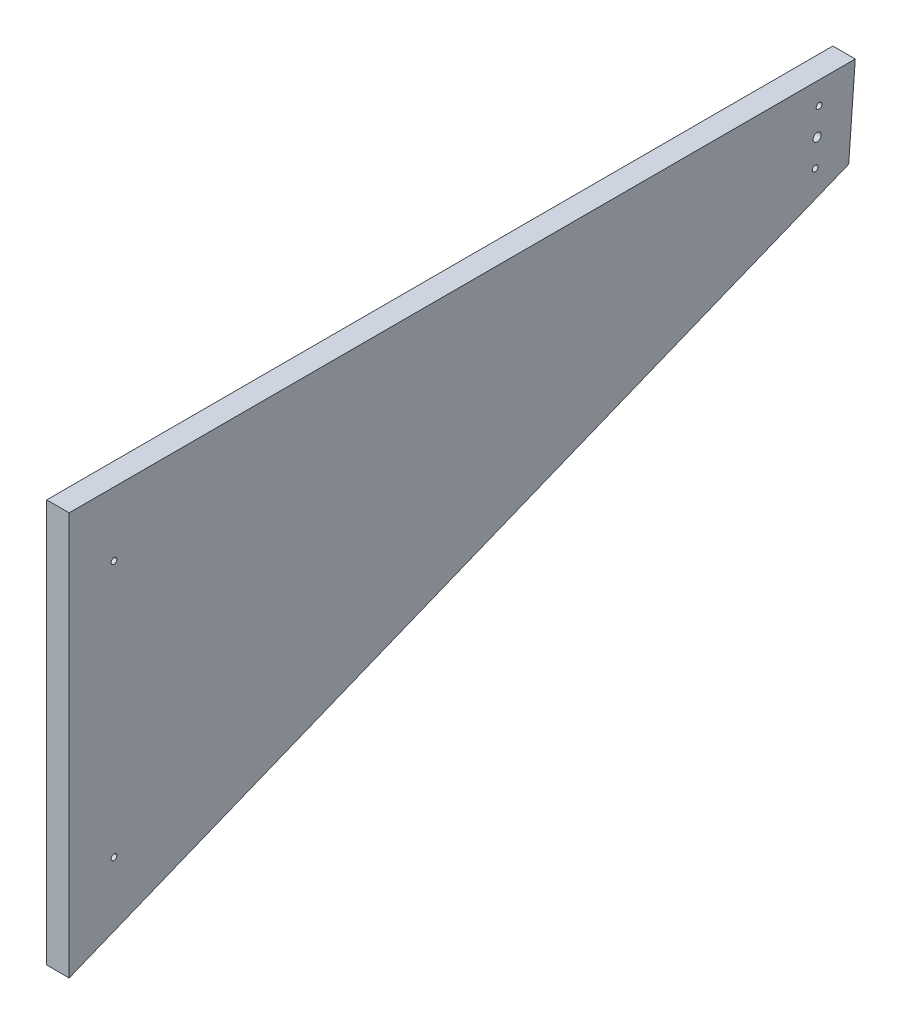
ISO-10303-21;
HEADER;
FILE_DESCRIPTION(('STEP AP214'),'2;1');
FILE_NAME('part.step','',(''),(''),'','','');
FILE_SCHEMA(('AUTOMOTIVE_DESIGN { 1 0 10303 214 1 1 1 1 }'));
ENDSEC;
DATA;
#1=APPLICATION_CONTEXT('core data for automotive mechanical design processes');
#2=APPLICATION_PROTOCOL_DEFINITION('international standard','automotive_design',2000,#1);
#3=PRODUCT_CONTEXT('',#1,'mechanical');
#4=PRODUCT('Part','Part','',(#3));
#5=PRODUCT_RELATED_PRODUCT_CATEGORY('part','',(#4));
#6=PRODUCT_DEFINITION_FORMATION('','',#4);
#7=PRODUCT_DEFINITION_CONTEXT('part definition',#1,'design');
#8=PRODUCT_DEFINITION('design','',#6,#7);
#9=PRODUCT_DEFINITION_SHAPE('','',#8);
#10=(LENGTH_UNIT() NAMED_UNIT(*) SI_UNIT(.MILLI.,.METRE.));
#11=(NAMED_UNIT(*) PLANE_ANGLE_UNIT() SI_UNIT($,.RADIAN.));
#12=(NAMED_UNIT(*) SI_UNIT($,.STERADIAN.) SOLID_ANGLE_UNIT());
#13=UNCERTAINTY_MEASURE_WITH_UNIT(LENGTH_MEASURE(1.E-05),#10,'distance_accuracy_value','');
#14=(GEOMETRIC_REPRESENTATION_CONTEXT(3) GLOBAL_UNCERTAINTY_ASSIGNED_CONTEXT((#13)) GLOBAL_UNIT_ASSIGNED_CONTEXT((#10,
#11,#12)) REPRESENTATION_CONTEXT('',''));
#15=CARTESIAN_POINT('',(0.,0.,0.));
#16=DIRECTION('',(0.,0.,1.));
#17=DIRECTION('',(1.,0.,0.));
#18=AXIS2_PLACEMENT_3D('',#15,#16,#17);
#19=CARTESIAN_POINT('',(285.75,6812.73593849404,-3017.19500052054));
#20=DIRECTION('',(1.,-1.19356260075187E-13,0.));
#21=DIRECTION('',(1.19356260075187E-13,1.,0.));
#22=AXIS2_PLACEMENT_3D('',#19,#20,#21);
#23=PLANE('',#22);
#24=CARTESIAN_POINT('',(285.750000000057,6964.61767983907,-3320.17307254985));
#25=DIRECTION('',(1.,0.,0.));
#26=DIRECTION('',(0.,0.,-1.));
#27=AXIS2_PLACEMENT_3D('',#24,#25,#26);
#28=CIRCLE('',#27,2.45744999999964);
#29=CARTESIAN_POINT('',(285.750000000057,6964.61767983907,-3322.63052254985));
#30=VERTEX_POINT('',#29);
#31=EDGE_CURVE('E142',#30,#30,#28,.T.);
#32=ORIENTED_EDGE('',*,*,#31,.F.);
#33=EDGE_LOOP('',(#32));
#34=FACE_BOUND('',#33,.T.);
#35=DIRECTION('',(0.,1.,0.));
#36=VECTOR('',#35,1.);
#37=CARTESIAN_POINT('',(285.750000000038,6641.741886848,-2683.51));
#38=LINE('',#37,#36);
#39=CARTESIAN_POINT('',(285.750000000022,6983.72999014007,-2683.51));
#40=VERTEX_POINT('',#39);
#41=CARTESIAN_POINT('',(285.750000000017,6641.741886848,-2683.51));
#42=VERTEX_POINT('',#41);
#43=EDGE_CURVE('E105',#40,#42,#38,.F.);
#44=ORIENTED_EDGE('',*,*,#43,.T.);
#45=DIRECTION('',(0.,-0.37460659341596,0.927183854566768));
#46=VECTOR('',#45,1.);
#47=CARTESIAN_POINT('',(285.750000000003,6909.11469486814,-3345.28092209158));
#48=LINE('',#47,#46);
#49=CARTESIAN_POINT('',(285.750000000002,6909.11469486814,-3345.28092209157));
#50=VERTEX_POINT('',#49);
#51=EDGE_CURVE('E97',#42,#50,#48,.F.);
#52=ORIENTED_EDGE('',*,*,#51,.T.);
#53=DIRECTION('',(0.,-0.997196386906744,0.0748289111248876));
#54=VECTOR('',#53,1.);
#55=CARTESIAN_POINT('',(285.750000000003,6983.72999014005,-3350.88000104107));
#56=LINE('',#55,#54);
#57=CARTESIAN_POINT('',(285.750000000006,6983.72999014005,-3350.88000104103));
#58=VERTEX_POINT('',#57);
#59=EDGE_CURVE('E85',#50,#58,#56,.F.);
#60=ORIENTED_EDGE('',*,*,#59,.T.);
#61=DIRECTION('',(0.,0.,-1.));
#62=VECTOR('',#61,1.);
#63=CARTESIAN_POINT('',(285.75000000001,6983.72999014007,-2683.51));
#64=LINE('',#63,#62);
#65=EDGE_CURVE('E88',#58,#40,#64,.F.);
#66=ORIENTED_EDGE('',*,*,#65,.T.);
#67=EDGE_LOOP('',(#44,#52,#60,#66));
#68=FACE_BOUND('',#67,.T.);
#69=CARTESIAN_POINT('',(285.750000000008,6942.45499014005,-3318.51));
#70=DIRECTION('',(1.,-1.19356260075173E-13,0.));
#71=DIRECTION('',(-1.19356260075173E-13,-1.,0.));
#72=AXIS2_PLACEMENT_3D('',#69,#70,#71);
#73=CIRCLE('',#72,3.49249999999985);
#74=CARTESIAN_POINT('',(285.750000000008,6938.96249014005,-3318.51));
#75=VERTEX_POINT('',#74);
#76=EDGE_CURVE('E41',#75,#75,#73,.T.);
#77=ORIENTED_EDGE('',*,*,#76,.F.);
#78=EDGE_LOOP('',(#77));
#79=FACE_BOUND('',#78,.T.);
#80=CARTESIAN_POINT('',(285.749999999997,6711.56773671743,-2721.6100000542));
#81=DIRECTION('',(-1.,1.19356260075187E-13,0.));
#82=DIRECTION('',(1.19356260075187E-13,1.,0.));
#83=AXIS2_PLACEMENT_3D('',#80,#81,#82);
#84=CIRCLE('',#83,2.45744999999964);
#85=CARTESIAN_POINT('',(285.749999999997,6714.02518671743,-2721.6100000542));
#86=VERTEX_POINT('',#85);
#87=EDGE_CURVE('E98',#86,#86,#84,.T.);
#88=ORIENTED_EDGE('',*,*,#87,.T.);
#89=EDGE_LOOP('',(#88));
#90=FACE_BOUND('',#89,.T.);
#91=CARTESIAN_POINT('',(285.750000000023,6929.29753945556,-2721.6100000542));
#92=DIRECTION('',(-1.,1.19356260075187E-13,0.));
#93=DIRECTION('',(1.19356260075187E-13,1.,0.));
#94=AXIS2_PLACEMENT_3D('',#91,#92,#93);
#95=CIRCLE('',#94,2.45744999999964);
#96=CARTESIAN_POINT('',(285.750000000023,6931.75498945556,-2721.6100000542));
#97=VERTEX_POINT('',#96);
#98=EDGE_CURVE('E124',#97,#97,#95,.T.);
#99=ORIENTED_EDGE('',*,*,#98,.T.);
#100=EDGE_LOOP('',(#99));
#101=FACE_BOUND('',#100,.T.);
#102=CARTESIAN_POINT('',(285.750000000053,6920.29230044106,-3316.84692745016));
#103=DIRECTION('',(1.,0.,0.));
#104=DIRECTION('',(0.,0.,-1.));
#105=AXIS2_PLACEMENT_3D('',#102,#103,#104);
#106=CIRCLE('',#105,2.45744999999964);
#107=CARTESIAN_POINT('',(285.750000000052,6920.29230044106,-3319.30437745015));
#108=VERTEX_POINT('',#107);
#109=EDGE_CURVE('E133',#108,#108,#106,.T.);
#110=ORIENTED_EDGE('',*,*,#109,.F.);
#111=EDGE_LOOP('',(#110));
#112=FACE_BOUND('',#111,.T.);
#113=ADVANCED_FACE('F38',(#34,#68,#79,#90,#101,#112),#23,.T.);
#114=CARTESIAN_POINT('',(266.70000000001,6983.72999014005,-3350.88000104107));
#115=DIRECTION('',(0.,-0.0748289111248876,-0.997196386906744));
#116=DIRECTION('',(0.,-0.997196386906744,0.0748289111248876));
#117=AXIS2_PLACEMENT_3D('',#114,#115,#116);
#118=PLANE('',#117);
#119=ORIENTED_EDGE('',*,*,#59,.F.);
#120=DIRECTION('',(1.,-1.12970962324406E-13,0.));
#121=VECTOR('',#120,1.);
#122=CARTESIAN_POINT('',(266.700000000002,6909.11469486815,-3345.28092209158));
#123=LINE('',#122,#121);
#124=CARTESIAN_POINT('',(266.700000000006,6909.11469486815,-3345.28092209157));
#125=VERTEX_POINT('',#124);
#126=EDGE_CURVE('E110',#50,#125,#123,.F.);
#127=ORIENTED_EDGE('',*,*,#126,.T.);
#128=DIRECTION('',(0.,0.997196386906838,-0.074828911123633));
#129=VECTOR('',#128,1.);
#130=CARTESIAN_POINT('',(266.700000000001,6909.11469486815,-3345.28092209158));
#131=LINE('',#130,#129);
#132=CARTESIAN_POINT('',(266.700000000017,6983.72999014006,-3350.88000104103));
#133=VERTEX_POINT('',#132);
#134=EDGE_CURVE('E87',#125,#133,#131,.T.);
#135=ORIENTED_EDGE('',*,*,#134,.T.);
#136=DIRECTION('',(-1.,1.19356260075187E-13,0.));
#137=VECTOR('',#136,1.);
#138=CARTESIAN_POINT('',(266.700000000038,6983.72999014007,-3350.880001041));
#139=LINE('',#138,#137);
#140=EDGE_CURVE('E81',#133,#58,#139,.F.);
#141=ORIENTED_EDGE('',*,*,#140,.T.);
#142=EDGE_LOOP('',(#119,#127,#135,#141));
#143=FACE_BOUND('',#142,.T.);
#144=ADVANCED_FACE('F82',(#143),#118,.T.);
#145=CARTESIAN_POINT('',(266.700000000038,6983.72999014007,-2683.51));
#146=DIRECTION('',(1.19356260075187E-13,1.,0.));
#147=DIRECTION('',(-1.,1.19356260075187E-13,0.));
#148=AXIS2_PLACEMENT_3D('',#145,#146,#147);
#149=PLANE('',#148);
#150=ORIENTED_EDGE('',*,*,#65,.F.);
#151=ORIENTED_EDGE('',*,*,#140,.F.);
#152=DIRECTION('',(0.,0.,-1.));
#153=VECTOR('',#152,1.);
#154=CARTESIAN_POINT('',(266.700000000023,6983.72999014007,-3017.19500052054));
#155=LINE('',#154,#153);
#156=CARTESIAN_POINT('',(266.700000000029,6983.72999014007,-2683.51));
#157=VERTEX_POINT('',#156);
#158=EDGE_CURVE('E113',#133,#157,#155,.F.);
#159=ORIENTED_EDGE('',*,*,#158,.T.);
#160=DIRECTION('',(-1.,0.,0.));
#161=VECTOR('',#160,1.);
#162=CARTESIAN_POINT('',(266.700000000002,6983.72999014007,-2683.51));
#163=LINE('',#162,#161);
#164=EDGE_CURVE('E74',#157,#40,#163,.F.);
#165=ORIENTED_EDGE('',*,*,#164,.T.);
#166=EDGE_LOOP('',(#150,#151,#159,#165));
#167=FACE_BOUND('',#166,.T.);
#168=ADVANCED_FACE('F90',(#167),#149,.T.);
#169=CARTESIAN_POINT('',(266.700000000002,6641.741886848,-2683.51));
#170=DIRECTION('',(0.,0.,1.));
#171=DIRECTION('',(-1.,0.,0.));
#172=AXIS2_PLACEMENT_3D('',#169,#170,#171);
#173=PLANE('',#172);
#174=ORIENTED_EDGE('',*,*,#43,.F.);
#175=ORIENTED_EDGE('',*,*,#164,.F.);
#176=DIRECTION('',(-1.03707897588097E-13,-1.,0.));
#177=VECTOR('',#176,1.);
#178=CARTESIAN_POINT('',(266.700000000019,6812.73593849404,-2683.51));
#179=LINE('',#178,#177);
#180=CARTESIAN_POINT('',(266.700000000002,6641.741886848,-2683.51));
#181=VERTEX_POINT('',#180);
#182=EDGE_CURVE('E115',#157,#181,#179,.T.);
#183=ORIENTED_EDGE('',*,*,#182,.T.);
#184=DIRECTION('',(1.,-1.12970962324406E-13,0.));
#185=VECTOR('',#184,1.);
#186=CARTESIAN_POINT('',(266.700000000002,6641.74188684799,-2683.51));
#187=LINE('',#186,#185);
#188=EDGE_CURVE('E107',#181,#42,#187,.T.);
#189=ORIENTED_EDGE('',*,*,#188,.T.);
#190=EDGE_LOOP('',(#174,#175,#183,#189));
#191=FACE_BOUND('',#190,.T.);
#192=ADVANCED_FACE('F177',(#191),#173,.T.);
#193=CARTESIAN_POINT('',(266.700000000002,6909.11469486815,-3345.28092209158));
#194=DIRECTION('',(-1.21843107780595E-13,-0.927183854566768,-0.37460659341596));
#195=DIRECTION('',(0.,-0.37460659341596,0.927183854566768));
#196=AXIS2_PLACEMENT_3D('',#193,#194,#195);
#197=PLANE('',#196);
#198=ORIENTED_EDGE('',*,*,#51,.F.);
#199=ORIENTED_EDGE('',*,*,#188,.F.);
#200=DIRECTION('',(0.,0.374606593415949,-0.927183854566772));
#201=VECTOR('',#200,1.);
#202=CARTESIAN_POINT('',(266.700000000001,6641.741886848,-2683.51));
#203=LINE('',#202,#201);
#204=EDGE_CURVE('E47',#181,#125,#203,.T.);
#205=ORIENTED_EDGE('',*,*,#204,.T.);
#206=ORIENTED_EDGE('',*,*,#126,.F.);
#207=EDGE_LOOP('',(#198,#199,#205,#206));
#208=FACE_BOUND('',#207,.T.);
#209=ADVANCED_FACE('F182',(#208),#197,.T.);
#210=CARTESIAN_POINT('',(285.750000000008,6942.45499014005,-3318.51));
#211=DIRECTION('',(-1.,1.19356260075173E-13,0.));
#212=DIRECTION('',(-1.19356260075173E-13,-1.,0.));
#213=AXIS2_PLACEMENT_3D('',#210,#211,#212);
#214=CYLINDRICAL_SURFACE('',#213,3.49249999999985);
#215=ORIENTED_EDGE('',*,*,#76,.T.);
#216=EDGE_LOOP('',(#215));
#217=FACE_BOUND('',#216,.T.);
#218=CARTESIAN_POINT('',(266.700000000013,6942.45499014005,-3318.51));
#219=DIRECTION('',(1.,-1.19356260075173E-13,0.));
#220=DIRECTION('',(-1.19356260075173E-13,-1.,0.));
#221=AXIS2_PLACEMENT_3D('',#218,#219,#220);
#222=CIRCLE('',#221,3.49249999999985);
#223=CARTESIAN_POINT('',(266.700000000013,6938.96249014005,-3318.51));
#224=VERTEX_POINT('',#223);
#225=EDGE_CURVE('E11',#224,#224,#222,.F.);
#226=ORIENTED_EDGE('',*,*,#225,.T.);
#227=EDGE_LOOP('',(#226));
#228=FACE_BOUND('',#227,.T.);
#229=ADVANCED_FACE('F186',(#217,#228),#214,.F.);
#230=CARTESIAN_POINT('',(266.700000000005,6812.73593849404,-3017.19500052054));
#231=DIRECTION('',(-1.,1.03707897588097E-13,0.));
#232=DIRECTION('',(-1.03707897588097E-13,-1.,0.));
#233=AXIS2_PLACEMENT_3D('',#230,#231,#232);
#234=PLANE('',#233);
#235=CARTESIAN_POINT('',(266.700000000008,6964.61767983907,-3320.17307254984));
#236=DIRECTION('',(1.,0.,0.));
#237=DIRECTION('',(0.,0.,-1.));
#238=AXIS2_PLACEMENT_3D('',#235,#236,#237);
#239=CIRCLE('',#238,4.21639999999979);
#240=CARTESIAN_POINT('',(266.700000000008,6964.61767983907,-3324.38947254984));
#241=VERTEX_POINT('',#240);
#242=EDGE_CURVE('E148',#241,#241,#239,.T.);
#243=ORIENTED_EDGE('',*,*,#242,.T.);
#244=EDGE_LOOP('',(#243));
#245=FACE_BOUND('',#244,.T.);
#246=CARTESIAN_POINT('',(266.700000000004,6920.29230044106,-3316.84692745015));
#247=DIRECTION('',(1.,0.,0.));
#248=DIRECTION('',(0.,0.,-1.));
#249=AXIS2_PLACEMENT_3D('',#246,#247,#248);
#250=CIRCLE('',#249,4.21639999999979);
#251=CARTESIAN_POINT('',(266.700000000004,6920.29230044106,-3321.06332745015));
#252=VERTEX_POINT('',#251);
#253=EDGE_CURVE('E139',#252,#252,#250,.T.);
#254=ORIENTED_EDGE('',*,*,#253,.T.);
#255=EDGE_LOOP('',(#254));
#256=FACE_BOUND('',#255,.T.);
#257=CARTESIAN_POINT('',(266.70000000003,6929.29753945556,-2721.6100000542));
#258=DIRECTION('',(1.,0.,0.));
#259=DIRECTION('',(0.,0.,-1.));
#260=AXIS2_PLACEMENT_3D('',#257,#258,#259);
#261=CIRCLE('',#260,4.21639999999979);
#262=CARTESIAN_POINT('',(266.700000000029,6929.29753945556,-2725.8264000542));
#263=VERTEX_POINT('',#262);
#264=EDGE_CURVE('E130',#263,#263,#261,.T.);
#265=ORIENTED_EDGE('',*,*,#264,.T.);
#266=EDGE_LOOP('',(#265));
#267=FACE_BOUND('',#266,.T.);
#268=CARTESIAN_POINT('',(266.700000000007,6711.56773671743,-2721.6100000542));
#269=DIRECTION('',(1.,0.,0.));
#270=DIRECTION('',(0.,0.,-1.));
#271=AXIS2_PLACEMENT_3D('',#268,#269,#270);
#272=CIRCLE('',#271,4.21639999999979);
#273=CARTESIAN_POINT('',(266.700000000007,6711.56773671743,-2725.8264000542));
#274=VERTEX_POINT('',#273);
#275=EDGE_CURVE('E121',#274,#274,#272,.T.);
#276=ORIENTED_EDGE('',*,*,#275,.T.);
#277=EDGE_LOOP('',(#276));
#278=FACE_BOUND('',#277,.T.);
#279=ORIENTED_EDGE('',*,*,#225,.F.);
#280=EDGE_LOOP('',(#279));
#281=FACE_BOUND('',#280,.T.);
#282=ORIENTED_EDGE('',*,*,#182,.F.);
#283=ORIENTED_EDGE('',*,*,#158,.F.);
#284=ORIENTED_EDGE('',*,*,#134,.F.);
#285=ORIENTED_EDGE('',*,*,#204,.F.);
#286=EDGE_LOOP('',(#282,#283,#284,#285));
#287=FACE_BOUND('',#286,.T.);
#288=ADVANCED_FACE('F152',(#245,#256,#267,#278,#281,#287),#234,.T.);
#289=CARTESIAN_POINT('',(266.700000000007,6711.56773671743,-2721.6100000542));
#290=DIRECTION('',(-1.,0.,0.));
#291=DIRECTION('',(0.,0.,-1.));
#292=AXIS2_PLACEMENT_3D('',#289,#290,#291);
#293=CYLINDRICAL_SURFACE('',#292,2.45744999999964);
#294=CARTESIAN_POINT('',(268.175934296266,6711.56773671743,-2721.6100000542));
#295=DIRECTION('',(1.,0.,0.));
#296=DIRECTION('',(0.,0.,-1.));
#297=AXIS2_PLACEMENT_3D('',#294,#295,#296);
#298=CIRCLE('',#297,2.45744999999964);
#299=CARTESIAN_POINT('',(268.175934296266,6711.56773671743,-2724.0674500542));
#300=VERTEX_POINT('',#299);
#301=EDGE_CURVE('E101',#300,#300,#298,.T.);
#302=ORIENTED_EDGE('',*,*,#301,.F.);
#303=EDGE_LOOP('',(#302));
#304=FACE_BOUND('',#303,.T.);
#305=ORIENTED_EDGE('',*,*,#87,.F.);
#306=EDGE_LOOP('',(#305));
#307=FACE_BOUND('',#306,.T.);
#308=ADVANCED_FACE('F193',(#304,#307),#293,.F.);
#309=CARTESIAN_POINT('',(266.700000000007,6711.56773671743,-2721.6100000542));
#310=DIRECTION('',(-1.,0.,0.));
#311=DIRECTION('',(0.,0.,-1.));
#312=AXIS2_PLACEMENT_3D('',#309,#310,#311);
#313=CONICAL_SURFACE('',#312,4.21639999999979,0.872664625997215);
#314=ORIENTED_EDGE('',*,*,#301,.T.);
#315=EDGE_LOOP('',(#314));
#316=FACE_BOUND('',#315,.T.);
#317=ORIENTED_EDGE('',*,*,#275,.F.);
#318=EDGE_LOOP('',(#317));
#319=FACE_BOUND('',#318,.T.);
#320=ADVANCED_FACE('F196',(#316,#319),#313,.F.);
#321=CARTESIAN_POINT('',(266.70000000003,6929.29753945556,-2721.6100000542));
#322=DIRECTION('',(-1.,0.,0.));
#323=DIRECTION('',(0.,0.,-1.));
#324=AXIS2_PLACEMENT_3D('',#321,#322,#323);
#325=CYLINDRICAL_SURFACE('',#324,2.45744999999964);
#326=CARTESIAN_POINT('',(268.175934296289,6929.29753945556,-2721.6100000542));
#327=DIRECTION('',(1.,0.,0.));
#328=DIRECTION('',(0.,0.,-1.));
#329=AXIS2_PLACEMENT_3D('',#326,#327,#328);
#330=CIRCLE('',#329,2.45744999999964);
#331=CARTESIAN_POINT('',(268.175934296289,6929.29753945556,-2724.0674500542));
#332=VERTEX_POINT('',#331);
#333=EDGE_CURVE('E127',#332,#332,#330,.T.);
#334=ORIENTED_EDGE('',*,*,#333,.F.);
#335=EDGE_LOOP('',(#334));
#336=FACE_BOUND('',#335,.T.);
#337=ORIENTED_EDGE('',*,*,#98,.F.);
#338=EDGE_LOOP('',(#337));
#339=FACE_BOUND('',#338,.T.);
#340=ADVANCED_FACE('F200',(#336,#339),#325,.F.);
#341=CARTESIAN_POINT('',(266.70000000003,6929.29753945556,-2721.6100000542));
#342=DIRECTION('',(-1.,0.,0.));
#343=DIRECTION('',(0.,0.,-1.));
#344=AXIS2_PLACEMENT_3D('',#341,#342,#343);
#345=CONICAL_SURFACE('',#344,4.21639999999979,0.872664625997215);
#346=ORIENTED_EDGE('',*,*,#333,.T.);
#347=EDGE_LOOP('',(#346));
#348=FACE_BOUND('',#347,.T.);
#349=ORIENTED_EDGE('',*,*,#264,.F.);
#350=EDGE_LOOP('',(#349));
#351=FACE_BOUND('',#350,.T.);
#352=ADVANCED_FACE('F204',(#348,#351),#345,.F.);
#353=CARTESIAN_POINT('',(266.700000000004,6920.29230044106,-3316.84692745015));
#354=DIRECTION('',(-1.,0.,0.));
#355=DIRECTION('',(0.,0.,-1.));
#356=AXIS2_PLACEMENT_3D('',#353,#354,#355);
#357=CYLINDRICAL_SURFACE('',#356,2.45744999999964);
#358=ORIENTED_EDGE('',*,*,#109,.T.);
#359=EDGE_LOOP('',(#358));
#360=FACE_BOUND('',#359,.T.);
#361=CARTESIAN_POINT('',(268.175934296263,6920.29230044106,-3316.84692745015));
#362=DIRECTION('',(1.,0.,0.));
#363=DIRECTION('',(0.,0.,-1.));
#364=AXIS2_PLACEMENT_3D('',#361,#362,#363);
#365=CIRCLE('',#364,2.45744999999964);
#366=CARTESIAN_POINT('',(268.175934296263,6920.29230044106,-3319.30437745015));
#367=VERTEX_POINT('',#366);
#368=EDGE_CURVE('E136',#367,#367,#365,.T.);
#369=ORIENTED_EDGE('',*,*,#368,.F.);
#370=EDGE_LOOP('',(#369));
#371=FACE_BOUND('',#370,.T.);
#372=ADVANCED_FACE('F208',(#360,#371),#357,.F.);
#373=CARTESIAN_POINT('',(266.700000000004,6920.29230044106,-3316.84692745015));
#374=DIRECTION('',(-1.,0.,0.));
#375=DIRECTION('',(0.,0.,-1.));
#376=AXIS2_PLACEMENT_3D('',#373,#374,#375);
#377=CONICAL_SURFACE('',#376,4.21639999999979,0.872664625997196);
#378=ORIENTED_EDGE('',*,*,#368,.T.);
#379=EDGE_LOOP('',(#378));
#380=FACE_BOUND('',#379,.T.);
#381=ORIENTED_EDGE('',*,*,#253,.F.);
#382=EDGE_LOOP('',(#381));
#383=FACE_BOUND('',#382,.T.);
#384=ADVANCED_FACE('F163',(#380,#383),#377,.F.);
#385=CARTESIAN_POINT('',(266.700000000008,6964.61767983907,-3320.17307254984));
#386=DIRECTION('',(-1.,0.,0.));
#387=DIRECTION('',(0.,0.,-1.));
#388=AXIS2_PLACEMENT_3D('',#385,#386,#387);
#389=CYLINDRICAL_SURFACE('',#388,2.45744999999964);
#390=ORIENTED_EDGE('',*,*,#31,.T.);
#391=EDGE_LOOP('',(#390));
#392=FACE_BOUND('',#391,.T.);
#393=CARTESIAN_POINT('',(268.175934296267,6964.61767983907,-3320.17307254984));
#394=DIRECTION('',(1.,0.,0.));
#395=DIRECTION('',(0.,0.,-1.));
#396=AXIS2_PLACEMENT_3D('',#393,#394,#395);
#397=CIRCLE('',#396,2.45744999999964);
#398=CARTESIAN_POINT('',(268.175934296267,6964.61767983907,-3322.63052254984));
#399=VERTEX_POINT('',#398);
#400=EDGE_CURVE('E145',#399,#399,#397,.T.);
#401=ORIENTED_EDGE('',*,*,#400,.F.);
#402=EDGE_LOOP('',(#401));
#403=FACE_BOUND('',#402,.T.);
#404=ADVANCED_FACE('F157',(#392,#403),#389,.F.);
#405=CARTESIAN_POINT('',(266.700000000008,6964.61767983907,-3320.17307254984));
#406=DIRECTION('',(-1.,0.,0.));
#407=DIRECTION('',(0.,0.,-1.));
#408=AXIS2_PLACEMENT_3D('',#405,#406,#407);
#409=CONICAL_SURFACE('',#408,4.21639999999979,0.872664625997196);
#410=ORIENTED_EDGE('',*,*,#400,.T.);
#411=EDGE_LOOP('',(#410));
#412=FACE_BOUND('',#411,.T.);
#413=ORIENTED_EDGE('',*,*,#242,.F.);
#414=EDGE_LOOP('',(#413));
#415=FACE_BOUND('',#414,.T.);
#416=ADVANCED_FACE('F155',(#412,#415),#409,.F.);
#417=CLOSED_SHELL('',(#113,#144,#168,#192,#209,#229,#288,#308,#320,#340,#352,#372,#384,#404,#416));
#418=MANIFOLD_SOLID_BREP('B2',#417);
#419=ADVANCED_BREP_SHAPE_REPRESENTATION('',(#18,#418),#14);
#420=SHAPE_DEFINITION_REPRESENTATION(#9,#419);
ENDSEC;
END-ISO-10303-21;
